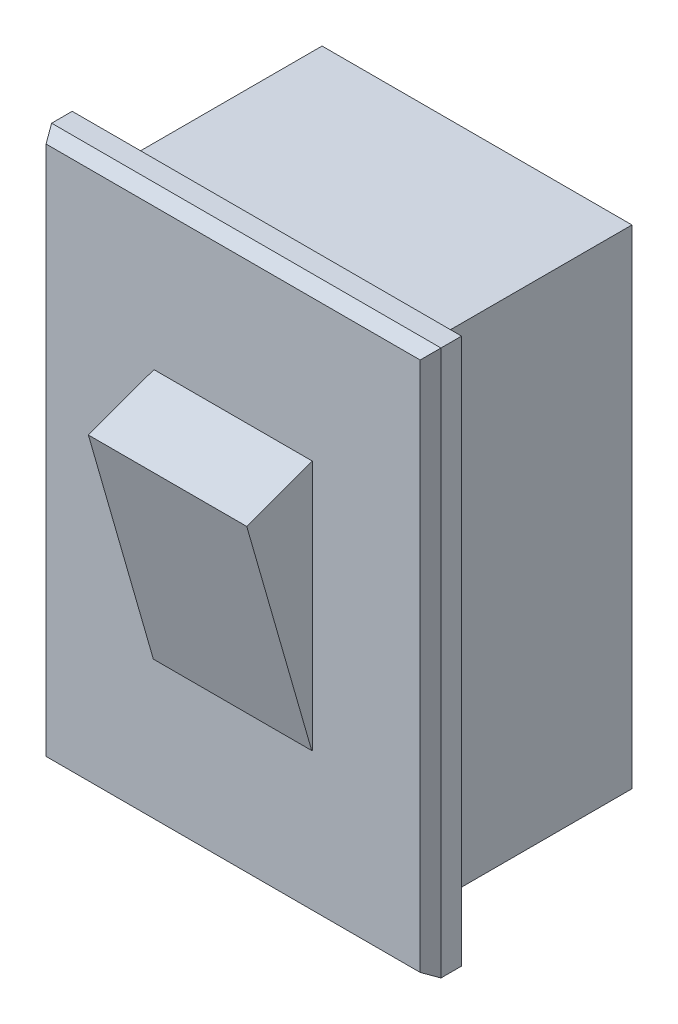
ISO-10303-21;
HEADER;
FILE_DESCRIPTION(('STEP AP214'),'2;1');
FILE_NAME('part.step','',(''),(''),'','','');
FILE_SCHEMA(('AUTOMOTIVE_DESIGN { 1 0 10303 214 1 1 1 1 }'));
ENDSEC;
DATA;
#1=APPLICATION_CONTEXT('core data for automotive mechanical design processes');
#2=APPLICATION_PROTOCOL_DEFINITION('international standard','automotive_design',2000,#1);
#3=PRODUCT_CONTEXT('',#1,'mechanical');
#4=PRODUCT('Part','Part','',(#3));
#5=PRODUCT_RELATED_PRODUCT_CATEGORY('part','',(#4));
#6=PRODUCT_DEFINITION_FORMATION('','',#4);
#7=PRODUCT_DEFINITION_CONTEXT('part definition',#1,'design');
#8=PRODUCT_DEFINITION('design','',#6,#7);
#9=PRODUCT_DEFINITION_SHAPE('','',#8);
#10=(LENGTH_UNIT() NAMED_UNIT(*) SI_UNIT(.MILLI.,.METRE.));
#11=(NAMED_UNIT(*) PLANE_ANGLE_UNIT() SI_UNIT($,.RADIAN.));
#12=(NAMED_UNIT(*) SI_UNIT($,.STERADIAN.) SOLID_ANGLE_UNIT());
#13=UNCERTAINTY_MEASURE_WITH_UNIT(LENGTH_MEASURE(1.E-05),#10,'distance_accuracy_value','');
#14=(GEOMETRIC_REPRESENTATION_CONTEXT(3) GLOBAL_UNCERTAINTY_ASSIGNED_CONTEXT((#13)) GLOBAL_UNIT_ASSIGNED_CONTEXT((#10,
#11,#12)) REPRESENTATION_CONTEXT('',''));
#15=CARTESIAN_POINT('',(0.,0.,0.));
#16=DIRECTION('',(0.,0.,1.));
#17=DIRECTION('',(1.,0.,0.));
#18=AXIS2_PLACEMENT_3D('',#15,#16,#17);
#19=CARTESIAN_POINT('',(0.,0.,0.));
#20=DIRECTION('',(0.,0.,1.));
#21=DIRECTION('',(1.,0.,0.));
#22=AXIS2_PLACEMENT_3D('',#19,#20,#21);
#23=PLANE('',#22);
#24=DIRECTION('',(0.,-1.,0.));
#25=VECTOR('',#24,1.);
#26=CARTESIAN_POINT('',(-7.375,-10.335,0.));
#27=LINE('',#26,#25);
#28=CARTESIAN_POINT('',(-7.375,10.335,0.));
#29=VERTEX_POINT('',#28);
#30=CARTESIAN_POINT('',(-7.375,-10.335,0.));
#31=VERTEX_POINT('',#30);
#32=EDGE_CURVE('E180',#29,#31,#27,.T.);
#33=ORIENTED_EDGE('',*,*,#32,.F.);
#34=DIRECTION('',(-1.,0.,0.));
#35=VECTOR('',#34,1.);
#36=CARTESIAN_POINT('',(7.375,10.335,0.));
#37=LINE('',#36,#35);
#38=CARTESIAN_POINT('',(7.375,10.335,0.));
#39=VERTEX_POINT('',#38);
#40=EDGE_CURVE('E189',#39,#29,#37,.T.);
#41=ORIENTED_EDGE('',*,*,#40,.F.);
#42=DIRECTION('',(0.,1.,0.));
#43=VECTOR('',#42,1.);
#44=CARTESIAN_POINT('',(7.375,-10.335,0.));
#45=LINE('',#44,#43);
#46=CARTESIAN_POINT('',(7.375,-10.335,0.));
#47=VERTEX_POINT('',#46);
#48=EDGE_CURVE('E186',#47,#39,#45,.T.);
#49=ORIENTED_EDGE('',*,*,#48,.F.);
#50=DIRECTION('',(1.,0.,0.));
#51=VECTOR('',#50,1.);
#52=CARTESIAN_POINT('',(7.375,-10.335,0.));
#53=LINE('',#52,#51);
#54=EDGE_CURVE('E183',#31,#47,#53,.T.);
#55=ORIENTED_EDGE('',*,*,#54,.F.);
#56=EDGE_LOOP('',(#33,#41,#49,#55));
#57=FACE_BOUND('',#56,.T.);
#58=DIRECTION('',(0.,-1.,0.));
#59=VECTOR('',#58,1.);
#60=CARTESIAN_POINT('',(5.87,-9.25,0.));
#61=LINE('',#60,#59);
#62=CARTESIAN_POINT('',(5.87,9.25,0.));
#63=VERTEX_POINT('',#62);
#64=CARTESIAN_POINT('',(5.87,-9.25,0.));
#65=VERTEX_POINT('',#64);
#66=EDGE_CURVE('E157',#63,#65,#61,.T.);
#67=ORIENTED_EDGE('',*,*,#66,.F.);
#68=DIRECTION('',(1.,0.,0.));
#69=VECTOR('',#68,1.);
#70=CARTESIAN_POINT('',(-5.87,9.25,0.));
#71=LINE('',#70,#69);
#72=CARTESIAN_POINT('',(-5.87,9.25,0.));
#73=VERTEX_POINT('',#72);
#74=EDGE_CURVE('E154',#73,#63,#71,.T.);
#75=ORIENTED_EDGE('',*,*,#74,.F.);
#76=DIRECTION('',(0.,1.,0.));
#77=VECTOR('',#76,1.);
#78=CARTESIAN_POINT('',(-5.87,-9.25,0.));
#79=LINE('',#78,#77);
#80=CARTESIAN_POINT('',(-5.87,-9.25,0.));
#81=VERTEX_POINT('',#80);
#82=EDGE_CURVE('E57',#81,#73,#79,.T.);
#83=ORIENTED_EDGE('',*,*,#82,.F.);
#84=DIRECTION('',(-1.,0.,0.));
#85=VECTOR('',#84,1.);
#86=CARTESIAN_POINT('',(-5.87,-9.25,0.));
#87=LINE('',#86,#85);
#88=EDGE_CURVE('E52',#65,#81,#87,.T.);
#89=ORIENTED_EDGE('',*,*,#88,.F.);
#90=EDGE_LOOP('',(#67,#75,#83,#89));
#91=FACE_BOUND('',#90,.T.);
#92=ADVANCED_FACE('F37',(#57,#91),#23,.F.);
#93=CARTESIAN_POINT('',(0.,0.,1.28));
#94=DIRECTION('',(0.,0.,1.));
#95=DIRECTION('',(1.,0.,0.));
#96=AXIS2_PLACEMENT_3D('',#93,#94,#95);
#97=PLANE('',#96);
#98=DIRECTION('',(0.,-1.,0.));
#99=VECTOR('',#98,1.);
#100=CARTESIAN_POINT('',(-7.08632486540518,-10.335,1.28));
#101=LINE('',#100,#99);
#102=CARTESIAN_POINT('',(-7.08632486540518,10.0463248654052,1.28));
#103=VERTEX_POINT('',#102);
#104=CARTESIAN_POINT('',(-7.08632486540518,-10.0463248654052,1.28));
#105=VERTEX_POINT('',#104);
#106=EDGE_CURVE('E202',#103,#105,#101,.T.);
#107=ORIENTED_EDGE('',*,*,#106,.T.);
#108=DIRECTION('',(1.,0.,0.));
#109=VECTOR('',#108,1.);
#110=CARTESIAN_POINT('',(7.375,-10.0463248654052,1.28));
#111=LINE('',#110,#109);
#112=CARTESIAN_POINT('',(7.08632486540518,-10.0463248654052,1.28));
#113=VERTEX_POINT('',#112);
#114=EDGE_CURVE('E206',#105,#113,#111,.T.);
#115=ORIENTED_EDGE('',*,*,#114,.T.);
#116=DIRECTION('',(0.,1.,0.));
#117=VECTOR('',#116,1.);
#118=CARTESIAN_POINT('',(7.08632486540518,10.335,1.28));
#119=LINE('',#118,#117);
#120=CARTESIAN_POINT('',(7.08632486540518,10.0463248654052,1.28));
#121=VERTEX_POINT('',#120);
#122=EDGE_CURVE('E204',#113,#121,#119,.T.);
#123=ORIENTED_EDGE('',*,*,#122,.T.);
#124=DIRECTION('',(-1.,0.,0.));
#125=VECTOR('',#124,1.);
#126=CARTESIAN_POINT('',(-7.375,10.0463248654052,1.28));
#127=LINE('',#126,#125);
#128=EDGE_CURVE('E200',#121,#103,#127,.T.);
#129=ORIENTED_EDGE('',*,*,#128,.T.);
#130=EDGE_LOOP('',(#107,#115,#123,#129));
#131=FACE_BOUND('',#130,.T.);
#132=DIRECTION('',(0.,-1.,0.));
#133=VECTOR('',#132,1.);
#134=CARTESIAN_POINT('',(-3.,4.8,1.28));
#135=LINE('',#134,#133);
#136=CARTESIAN_POINT('',(-3.,4.68816614723631,1.28));
#137=VERTEX_POINT('',#136);
#138=CARTESIAN_POINT('',(-3.,-4.8,1.28));
#139=VERTEX_POINT('',#138);
#140=EDGE_CURVE('E166',#137,#139,#135,.T.);
#141=ORIENTED_EDGE('',*,*,#140,.F.);
#142=DIRECTION('',(1.,0.,0.));
#143=VECTOR('',#142,1.);
#144=CARTESIAN_POINT('',(3.,4.68816614723631,1.28));
#145=LINE('',#144,#143);
#146=CARTESIAN_POINT('',(3.,4.68816614723631,1.28));
#147=VERTEX_POINT('',#146);
#148=EDGE_CURVE('E229',#137,#147,#145,.T.);
#149=ORIENTED_EDGE('',*,*,#148,.T.);
#150=DIRECTION('',(0.,1.,0.));
#151=VECTOR('',#150,1.);
#152=CARTESIAN_POINT('',(3.,-4.8,1.28));
#153=LINE('',#152,#151);
#154=CARTESIAN_POINT('',(3.,-4.8,1.28));
#155=VERTEX_POINT('',#154);
#156=EDGE_CURVE('E173',#155,#147,#153,.T.);
#157=ORIENTED_EDGE('',*,*,#156,.F.);
#158=DIRECTION('',(1.,0.,0.));
#159=VECTOR('',#158,1.);
#160=CARTESIAN_POINT('',(0.,-4.8,1.28));
#161=LINE('',#160,#159);
#162=EDGE_CURVE('E169',#139,#155,#161,.T.);
#163=ORIENTED_EDGE('',*,*,#162,.F.);
#164=EDGE_LOOP('',(#141,#149,#157,#163));
#165=FACE_BOUND('',#164,.T.);
#166=ADVANCED_FACE('F256',(#131,#165),#97,.T.);
#167=CARTESIAN_POINT('',(-7.375,-10.335,1.28));
#168=DIRECTION('',(1.,0.,0.));
#169=DIRECTION('',(0.,0.,-1.));
#170=AXIS2_PLACEMENT_3D('',#167,#168,#169);
#171=PLANE('',#170);
#172=DIRECTION('',(0.,0.,-1.));
#173=VECTOR('',#172,1.);
#174=CARTESIAN_POINT('',(-7.375,-10.335,1.28));
#175=LINE('',#174,#173);
#176=CARTESIAN_POINT('',(-7.375,-10.335,0.779999999999993));
#177=VERTEX_POINT('',#176);
#178=EDGE_CURVE('E198',#177,#31,#175,.T.);
#179=ORIENTED_EDGE('',*,*,#178,.F.);
#180=DIRECTION('',(0.,1.,0.));
#181=VECTOR('',#180,1.);
#182=CARTESIAN_POINT('',(-7.375,10.335,0.779999999999993));
#183=LINE('',#182,#181);
#184=CARTESIAN_POINT('',(-7.375,10.335,0.779999999999993));
#185=VERTEX_POINT('',#184);
#186=EDGE_CURVE('E214',#177,#185,#183,.T.);
#187=ORIENTED_EDGE('',*,*,#186,.T.);
#188=DIRECTION('',(0.,0.,-1.));
#189=VECTOR('',#188,1.);
#190=CARTESIAN_POINT('',(-7.375,10.335,1.28));
#191=LINE('',#190,#189);
#192=EDGE_CURVE('E192',#185,#29,#191,.T.);
#193=ORIENTED_EDGE('',*,*,#192,.T.);
#194=ORIENTED_EDGE('',*,*,#32,.T.);
#195=EDGE_LOOP('',(#179,#187,#193,#194));
#196=FACE_BOUND('',#195,.T.);
#197=ADVANCED_FACE('F258',(#196),#171,.F.);
#198=CARTESIAN_POINT('',(7.375,-10.335,1.28));
#199=DIRECTION('',(0.,1.,0.));
#200=DIRECTION('',(-1.,0.,0.));
#201=AXIS2_PLACEMENT_3D('',#198,#199,#200);
#202=PLANE('',#201);
#203=DIRECTION('',(0.,0.,-1.));
#204=VECTOR('',#203,1.);
#205=CARTESIAN_POINT('',(7.375,-10.335,1.28));
#206=LINE('',#205,#204);
#207=CARTESIAN_POINT('',(7.375,-10.335,0.779999999999993));
#208=VERTEX_POINT('',#207);
#209=EDGE_CURVE('E196',#208,#47,#206,.T.);
#210=ORIENTED_EDGE('',*,*,#209,.F.);
#211=DIRECTION('',(-1.,0.,0.));
#212=VECTOR('',#211,1.);
#213=CARTESIAN_POINT('',(-7.375,-10.335,0.779999999999993));
#214=LINE('',#213,#212);
#215=EDGE_CURVE('E209',#208,#177,#214,.T.);
#216=ORIENTED_EDGE('',*,*,#215,.T.);
#217=ORIENTED_EDGE('',*,*,#178,.T.);
#218=ORIENTED_EDGE('',*,*,#54,.T.);
#219=EDGE_LOOP('',(#210,#216,#217,#218));
#220=FACE_BOUND('',#219,.T.);
#221=ADVANCED_FACE('F265',(#220),#202,.F.);
#222=CARTESIAN_POINT('',(7.375,-10.335,1.28));
#223=DIRECTION('',(-1.,0.,0.));
#224=DIRECTION('',(0.,0.,1.));
#225=AXIS2_PLACEMENT_3D('',#222,#223,#224);
#226=PLANE('',#225);
#227=DIRECTION('',(0.,0.,-1.));
#228=VECTOR('',#227,1.);
#229=CARTESIAN_POINT('',(7.375,10.335,1.28));
#230=LINE('',#229,#228);
#231=CARTESIAN_POINT('',(7.375,10.335,0.779999999999993));
#232=VERTEX_POINT('',#231);
#233=EDGE_CURVE('E194',#232,#39,#230,.T.);
#234=ORIENTED_EDGE('',*,*,#233,.F.);
#235=DIRECTION('',(0.,-1.,0.));
#236=VECTOR('',#235,1.);
#237=CARTESIAN_POINT('',(7.375,-10.335,0.779999999999993));
#238=LINE('',#237,#236);
#239=EDGE_CURVE('E212',#232,#208,#238,.T.);
#240=ORIENTED_EDGE('',*,*,#239,.T.);
#241=ORIENTED_EDGE('',*,*,#209,.T.);
#242=ORIENTED_EDGE('',*,*,#48,.T.);
#243=EDGE_LOOP('',(#234,#240,#241,#242));
#244=FACE_BOUND('',#243,.T.);
#245=ADVANCED_FACE('F276',(#244),#226,.F.);
#246=CARTESIAN_POINT('',(7.375,10.335,1.28));
#247=DIRECTION('',(0.,-1.,0.));
#248=DIRECTION('',(1.,0.,0.));
#249=AXIS2_PLACEMENT_3D('',#246,#247,#248);
#250=PLANE('',#249);
#251=ORIENTED_EDGE('',*,*,#192,.F.);
#252=DIRECTION('',(1.,0.,0.));
#253=VECTOR('',#252,1.);
#254=CARTESIAN_POINT('',(7.375,10.335,0.779999999999993));
#255=LINE('',#254,#253);
#256=EDGE_CURVE('E216',#185,#232,#255,.T.);
#257=ORIENTED_EDGE('',*,*,#256,.T.);
#258=ORIENTED_EDGE('',*,*,#233,.T.);
#259=ORIENTED_EDGE('',*,*,#40,.T.);
#260=EDGE_LOOP('',(#251,#257,#258,#259));
#261=FACE_BOUND('',#260,.T.);
#262=ADVANCED_FACE('F273',(#261),#250,.F.);
#263=CARTESIAN_POINT('',(-3.,4.8,4.28));
#264=DIRECTION('',(1.,0.,0.));
#265=DIRECTION('',(0.,0.,-1.));
#266=AXIS2_PLACEMENT_3D('',#263,#264,#265);
#267=PLANE('',#266);
#268=DIRECTION('',(0.,0.,-1.));
#269=VECTOR('',#268,1.);
#270=CARTESIAN_POINT('',(-3.,-4.8,4.28));
#271=LINE('',#270,#269);
#272=CARTESIAN_POINT('',(-3.,-4.8,1.30133188768047));
#273=VERTEX_POINT('',#272);
#274=EDGE_CURVE('E178',#273,#139,#271,.T.);
#275=ORIENTED_EDGE('',*,*,#274,.F.);
#276=DIRECTION('',(0.,0.961261695938318,0.275637355817003));
#277=VECTOR('',#276,1.);
#278=CARTESIAN_POINT('',(-3.,-4.8,1.30133188768047));
#279=LINE('',#278,#277);
#280=CARTESIAN_POINT('',(-3.,3.78446858586997,3.76288864387016));
#281=VERTEX_POINT('',#280);
#282=EDGE_CURVE('E234',#273,#281,#279,.T.);
#283=ORIENTED_EDGE('',*,*,#282,.T.);
#284=DIRECTION('',(0.,0.342020143325676,-0.939692620785906));
#285=VECTOR('',#284,1.);
#286=CARTESIAN_POINT('',(-3.,4.8,0.972739014801146));
#287=LINE('',#286,#285);
#288=EDGE_CURVE('E227',#281,#137,#287,.T.);
#289=ORIENTED_EDGE('',*,*,#288,.T.);
#290=ORIENTED_EDGE('',*,*,#140,.T.);
#291=EDGE_LOOP('',(#275,#283,#289,#290));
#292=FACE_BOUND('',#291,.T.);
#293=ADVANCED_FACE('F252',(#292),#267,.F.);
#294=CARTESIAN_POINT('',(0.,-4.8,4.28));
#295=DIRECTION('',(0.,1.,0.));
#296=DIRECTION('',(0.,0.,1.));
#297=AXIS2_PLACEMENT_3D('',#294,#295,#296);
#298=PLANE('',#297);
#299=DIRECTION('',(0.,0.,-1.));
#300=VECTOR('',#299,1.);
#301=CARTESIAN_POINT('',(3.,-4.8,4.28));
#302=LINE('',#301,#300);
#303=CARTESIAN_POINT('',(3.,-4.8,1.30133188768047));
#304=VERTEX_POINT('',#303);
#305=EDGE_CURVE('E176',#304,#155,#302,.T.);
#306=ORIENTED_EDGE('',*,*,#305,.F.);
#307=DIRECTION('',(-1.,0.,0.));
#308=VECTOR('',#307,1.);
#309=CARTESIAN_POINT('',(-3.,-4.8,1.30133188768047));
#310=LINE('',#309,#308);
#311=EDGE_CURVE('E231',#304,#273,#310,.T.);
#312=ORIENTED_EDGE('',*,*,#311,.T.);
#313=ORIENTED_EDGE('',*,*,#274,.T.);
#314=ORIENTED_EDGE('',*,*,#162,.T.);
#315=EDGE_LOOP('',(#306,#312,#313,#314));
#316=FACE_BOUND('',#315,.T.);
#317=ADVANCED_FACE('F250',(#316),#298,.F.);
#318=CARTESIAN_POINT('',(3.,-4.8,4.28));
#319=DIRECTION('',(-1.,0.,0.));
#320=DIRECTION('',(0.,0.,1.));
#321=AXIS2_PLACEMENT_3D('',#318,#319,#320);
#322=PLANE('',#321);
#323=DIRECTION('',(0.,-0.342020143325676,0.939692620785906));
#324=VECTOR('',#323,1.);
#325=CARTESIAN_POINT('',(3.,4.8,0.972739014801146));
#326=LINE('',#325,#324);
#327=CARTESIAN_POINT('',(3.,3.78446858586997,3.76288864387016));
#328=VERTEX_POINT('',#327);
#329=EDGE_CURVE('E217',#147,#328,#326,.T.);
#330=ORIENTED_EDGE('',*,*,#329,.T.);
#331=DIRECTION('',(0.,-0.961261695938318,-0.275637355817003));
#332=VECTOR('',#331,1.);
#333=CARTESIAN_POINT('',(3.,-4.8,1.30133188768047));
#334=LINE('',#333,#332);
#335=EDGE_CURVE('E11',#328,#304,#334,.T.);
#336=ORIENTED_EDGE('',*,*,#335,.T.);
#337=ORIENTED_EDGE('',*,*,#305,.T.);
#338=ORIENTED_EDGE('',*,*,#156,.T.);
#339=EDGE_LOOP('',(#330,#336,#337,#338));
#340=FACE_BOUND('',#339,.T.);
#341=ADVANCED_FACE('F244',(#340),#322,.F.);
#342=CARTESIAN_POINT('',(0.,10.0463248654052,1.28));
#343=DIRECTION('',(0.,0.866025403784439,0.499999999999999));
#344=DIRECTION('',(1.,0.,0.));
#345=AXIS2_PLACEMENT_3D('',#342,#343,#344);
#346=PLANE('',#345);
#347=DIRECTION('',(0.447213595499957,0.447213595499958,-0.774596669241484));
#348=VECTOR('',#347,1.);
#349=CARTESIAN_POINT('',(5.66905989232415,8.62905989232415,3.73477494116409));
#350=LINE('',#349,#348);
#351=EDGE_CURVE('E220',#232,#121,#350,.F.);
#352=ORIENTED_EDGE('',*,*,#351,.F.);
#353=ORIENTED_EDGE('',*,*,#256,.F.);
#354=DIRECTION('',(0.447213595499957,-0.447213595499957,0.774596669241484));
#355=VECTOR('',#354,1.);
#356=CARTESIAN_POINT('',(-5.66905989232415,8.62905989232415,3.73477494116409));
#357=LINE('',#356,#355);
#358=EDGE_CURVE('E170',#103,#185,#357,.F.);
#359=ORIENTED_EDGE('',*,*,#358,.F.);
#360=ORIENTED_EDGE('',*,*,#128,.F.);
#361=EDGE_LOOP('',(#352,#353,#359,#360));
#362=FACE_BOUND('',#361,.T.);
#363=ADVANCED_FACE('F295',(#362),#346,.T.);
#364=CARTESIAN_POINT('',(-7.08632486540518,0.,1.28));
#365=DIRECTION('',(-0.866025403784439,0.,0.499999999999999));
#366=DIRECTION('',(0.,1.,0.));
#367=AXIS2_PLACEMENT_3D('',#364,#365,#366);
#368=PLANE('',#367);
#369=ORIENTED_EDGE('',*,*,#358,.T.);
#370=ORIENTED_EDGE('',*,*,#186,.F.);
#371=DIRECTION('',(0.447213595499957,0.447213595499958,0.774596669241484));
#372=VECTOR('',#371,1.);
#373=CARTESIAN_POINT('',(-5.07705989232415,-8.03705989232415,4.76014901924487));
#374=LINE('',#373,#372);
#375=EDGE_CURVE('E160',#105,#177,#374,.F.);
#376=ORIENTED_EDGE('',*,*,#375,.F.);
#377=ORIENTED_EDGE('',*,*,#106,.F.);
#378=EDGE_LOOP('',(#369,#370,#376,#377));
#379=FACE_BOUND('',#378,.T.);
#380=ADVANCED_FACE('F291',(#379),#368,.T.);
#381=CARTESIAN_POINT('',(7.08632486540518,0.,1.28));
#382=DIRECTION('',(0.866025403784439,0.,0.499999999999999));
#383=DIRECTION('',(0.,-1.,0.));
#384=AXIS2_PLACEMENT_3D('',#381,#382,#383);
#385=PLANE('',#384);
#386=ORIENTED_EDGE('',*,*,#351,.T.);
#387=ORIENTED_EDGE('',*,*,#122,.F.);
#388=DIRECTION('',(0.447213595499957,-0.447213595499957,-0.774596669241484));
#389=VECTOR('',#388,1.);
#390=CARTESIAN_POINT('',(5.07705989232415,-8.03705989232415,4.76014901924487));
#391=LINE('',#390,#389);
#392=EDGE_CURVE('E158',#208,#113,#391,.F.);
#393=ORIENTED_EDGE('',*,*,#392,.F.);
#394=ORIENTED_EDGE('',*,*,#239,.F.);
#395=EDGE_LOOP('',(#386,#387,#393,#394));
#396=FACE_BOUND('',#395,.T.);
#397=ADVANCED_FACE('F287',(#396),#385,.T.);
#398=CARTESIAN_POINT('',(0.,-10.0463248654052,1.28));
#399=DIRECTION('',(0.,-0.866025403784439,0.499999999999999));
#400=DIRECTION('',(-1.,0.,0.));
#401=AXIS2_PLACEMENT_3D('',#398,#399,#400);
#402=PLANE('',#401);
#403=ORIENTED_EDGE('',*,*,#375,.T.);
#404=ORIENTED_EDGE('',*,*,#215,.F.);
#405=ORIENTED_EDGE('',*,*,#392,.T.);
#406=ORIENTED_EDGE('',*,*,#114,.F.);
#407=EDGE_LOOP('',(#403,#404,#405,#406));
#408=FACE_BOUND('',#407,.T.);
#409=ADVANCED_FACE('F284',(#408),#402,.T.);
#410=CARTESIAN_POINT('',(3.,4.8,0.972739014801146));
#411=DIRECTION('',(0.,0.939692620785906,0.342020143325676));
#412=DIRECTION('',(-1.,0.,0.));
#413=AXIS2_PLACEMENT_3D('',#410,#411,#412);
#414=PLANE('',#413);
#415=ORIENTED_EDGE('',*,*,#288,.F.);
#416=DIRECTION('',(1.,0.,0.));
#417=VECTOR('',#416,1.);
#418=CARTESIAN_POINT('',(3.,3.78446858586997,3.76288864387016));
#419=LINE('',#418,#417);
#420=EDGE_CURVE('E45',#281,#328,#419,.T.);
#421=ORIENTED_EDGE('',*,*,#420,.T.);
#422=ORIENTED_EDGE('',*,*,#329,.F.);
#423=ORIENTED_EDGE('',*,*,#148,.F.);
#424=EDGE_LOOP('',(#415,#421,#422,#423));
#425=FACE_BOUND('',#424,.T.);
#426=ADVANCED_FACE('F239',(#425),#414,.T.);
#427=CARTESIAN_POINT('',(0.,-4.8,1.30133188768047));
#428=DIRECTION('',(0.,-0.275637355817003,0.961261695938318));
#429=DIRECTION('',(1.,0.,0.));
#430=AXIS2_PLACEMENT_3D('',#427,#428,#429);
#431=PLANE('',#430);
#432=ORIENTED_EDGE('',*,*,#335,.F.);
#433=ORIENTED_EDGE('',*,*,#420,.F.);
#434=ORIENTED_EDGE('',*,*,#282,.F.);
#435=ORIENTED_EDGE('',*,*,#311,.F.);
#436=EDGE_LOOP('',(#432,#433,#434,#435));
#437=FACE_BOUND('',#436,.T.);
#438=ADVANCED_FACE('F39',(#437),#431,.T.);
#439=CARTESIAN_POINT('',(5.87,-9.25,-7.96));
#440=DIRECTION('',(-1.,0.,0.));
#441=DIRECTION('',(0.,0.,1.));
#442=AXIS2_PLACEMENT_3D('',#439,#440,#441);
#443=PLANE('',#442);
#444=ORIENTED_EDGE('',*,*,#66,.T.);
#445=DIRECTION('',(0.,0.,1.));
#446=VECTOR('',#445,1.);
#447=CARTESIAN_POINT('',(5.87,-9.25,-7.96));
#448=LINE('',#447,#446);
#449=CARTESIAN_POINT('',(5.87,-9.25,-7.96));
#450=VERTEX_POINT('',#449);
#451=EDGE_CURVE('E138',#450,#65,#448,.T.);
#452=ORIENTED_EDGE('',*,*,#451,.F.);
#453=DIRECTION('',(0.,-1.,0.));
#454=VECTOR('',#453,1.);
#455=CARTESIAN_POINT('',(5.87,-9.25,-7.96));
#456=LINE('',#455,#454);
#457=CARTESIAN_POINT('',(5.87,9.25,-7.96));
#458=VERTEX_POINT('',#457);
#459=EDGE_CURVE('E145',#458,#450,#456,.T.);
#460=ORIENTED_EDGE('',*,*,#459,.F.);
#461=DIRECTION('',(0.,0.,1.));
#462=VECTOR('',#461,1.);
#463=CARTESIAN_POINT('',(5.87,9.25,-7.96));
#464=LINE('',#463,#462);
#465=EDGE_CURVE('E442',#458,#63,#464,.T.);
#466=ORIENTED_EDGE('',*,*,#465,.T.);
#467=EDGE_LOOP('',(#444,#452,#460,#466));
#468=FACE_BOUND('',#467,.T.);
#469=ADVANCED_FACE('F156',(#468),#443,.F.);
#470=CARTESIAN_POINT('',(-5.87,-9.25,-7.96));
#471=DIRECTION('',(0.,1.,0.));
#472=DIRECTION('',(-1.,0.,0.));
#473=AXIS2_PLACEMENT_3D('',#470,#471,#472);
#474=PLANE('',#473);
#475=ORIENTED_EDGE('',*,*,#88,.T.);
#476=DIRECTION('',(0.,0.,1.));
#477=VECTOR('',#476,1.);
#478=CARTESIAN_POINT('',(-5.87,-9.25,-7.96));
#479=LINE('',#478,#477);
#480=CARTESIAN_POINT('',(-5.87,-9.25,-7.96));
#481=VERTEX_POINT('',#480);
#482=EDGE_CURVE('E141',#481,#81,#479,.T.);
#483=ORIENTED_EDGE('',*,*,#482,.F.);
#484=DIRECTION('',(-1.,0.,0.));
#485=VECTOR('',#484,1.);
#486=CARTESIAN_POINT('',(-5.87,-9.25,-7.96));
#487=LINE('',#486,#485);
#488=EDGE_CURVE('E134',#450,#481,#487,.T.);
#489=ORIENTED_EDGE('',*,*,#488,.F.);
#490=ORIENTED_EDGE('',*,*,#451,.T.);
#491=EDGE_LOOP('',(#475,#483,#489,#490));
#492=FACE_BOUND('',#491,.T.);
#493=ADVANCED_FACE('F136',(#492),#474,.F.);
#494=CARTESIAN_POINT('',(-5.87,-9.25,-7.96));
#495=DIRECTION('',(1.,0.,0.));
#496=DIRECTION('',(0.,0.,-1.));
#497=AXIS2_PLACEMENT_3D('',#494,#495,#496);
#498=PLANE('',#497);
#499=ORIENTED_EDGE('',*,*,#82,.T.);
#500=DIRECTION('',(0.,0.,1.));
#501=VECTOR('',#500,1.);
#502=CARTESIAN_POINT('',(-5.87,9.25,-7.96));
#503=LINE('',#502,#501);
#504=CARTESIAN_POINT('',(-5.87,9.25,-7.96));
#505=VERTEX_POINT('',#504);
#506=EDGE_CURVE('E162',#505,#73,#503,.T.);
#507=ORIENTED_EDGE('',*,*,#506,.F.);
#508=DIRECTION('',(0.,1.,0.));
#509=VECTOR('',#508,1.);
#510=CARTESIAN_POINT('',(-5.87,-9.25,-7.96));
#511=LINE('',#510,#509);
#512=EDGE_CURVE('E144',#481,#505,#511,.T.);
#513=ORIENTED_EDGE('',*,*,#512,.F.);
#514=ORIENTED_EDGE('',*,*,#482,.T.);
#515=EDGE_LOOP('',(#499,#507,#513,#514));
#516=FACE_BOUND('',#515,.T.);
#517=ADVANCED_FACE('F310',(#516),#498,.F.);
#518=CARTESIAN_POINT('',(-5.87,9.25,-7.96));
#519=DIRECTION('',(0.,-1.,0.));
#520=DIRECTION('',(1.,0.,0.));
#521=AXIS2_PLACEMENT_3D('',#518,#519,#520);
#522=PLANE('',#521);
#523=ORIENTED_EDGE('',*,*,#74,.T.);
#524=ORIENTED_EDGE('',*,*,#465,.F.);
#525=DIRECTION('',(1.,0.,0.));
#526=VECTOR('',#525,1.);
#527=CARTESIAN_POINT('',(-5.87,9.25,-7.96));
#528=LINE('',#527,#526);
#529=EDGE_CURVE('E150',#505,#458,#528,.T.);
#530=ORIENTED_EDGE('',*,*,#529,.F.);
#531=ORIENTED_EDGE('',*,*,#506,.T.);
#532=EDGE_LOOP('',(#523,#524,#530,#531));
#533=FACE_BOUND('',#532,.T.);
#534=ADVANCED_FACE('F419',(#533),#522,.F.);
#535=CARTESIAN_POINT('',(0.,0.,-7.96));
#536=DIRECTION('',(0.,0.,-1.));
#537=DIRECTION('',(-1.,0.,0.));
#538=AXIS2_PLACEMENT_3D('',#535,#536,#537);
#539=PLANE('',#538);
#540=ORIENTED_EDGE('',*,*,#459,.T.);
#541=ORIENTED_EDGE('',*,*,#488,.T.);
#542=ORIENTED_EDGE('',*,*,#512,.T.);
#543=ORIENTED_EDGE('',*,*,#529,.T.);
#544=EDGE_LOOP('',(#540,#541,#542,#543));
#545=FACE_BOUND('',#544,.T.);
#546=ADVANCED_FACE('F148',(#545),#539,.T.);
#547=CLOSED_SHELL('',(#92,#166,#197,#221,#245,#262,#293,#317,#341,#363,#380,#397,#409,#426,#438,
#469,#493,#517,#534,#546));
#548=MANIFOLD_SOLID_BREP('B2',#547);
#549=ADVANCED_BREP_SHAPE_REPRESENTATION('',(#18,#548),#14);
#550=SHAPE_DEFINITION_REPRESENTATION(#9,#549);
ENDSEC;
END-ISO-10303-21;
